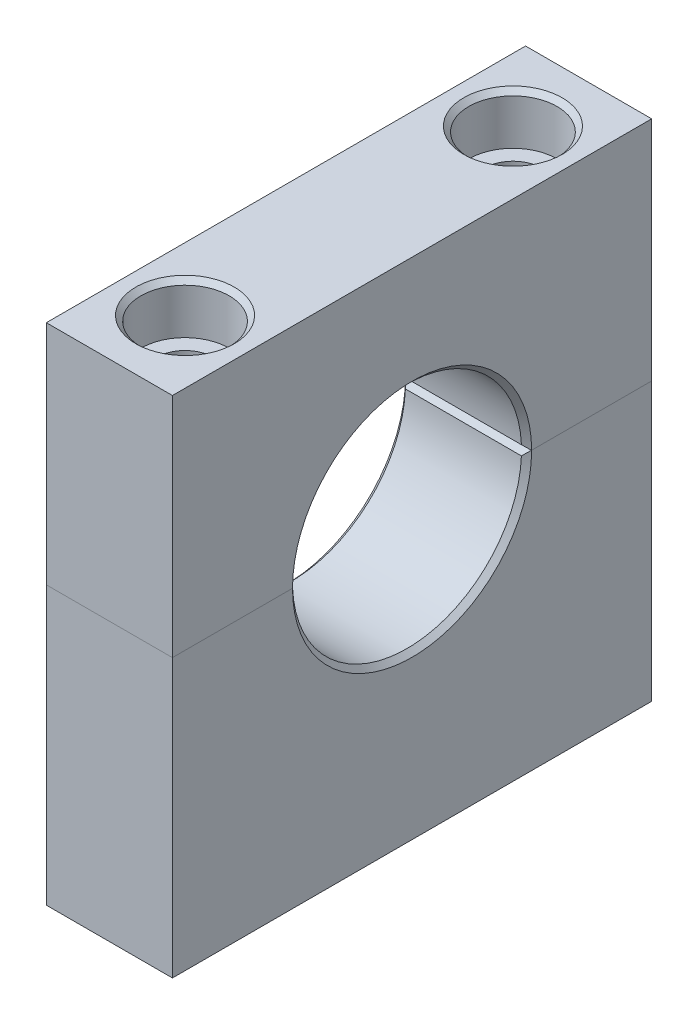
ISO-10303-21;
HEADER;
FILE_DESCRIPTION(('STEP AP214'),'2;1');
FILE_NAME('part.step','',(''),(''),'','','');
FILE_SCHEMA(('AUTOMOTIVE_DESIGN { 1 0 10303 214 1 1 1 1 }'));
ENDSEC;
DATA;
#1=APPLICATION_CONTEXT('core data for automotive mechanical design processes');
#2=APPLICATION_PROTOCOL_DEFINITION('international standard','automotive_design',2000,#1);
#3=PRODUCT_CONTEXT('',#1,'mechanical');
#4=PRODUCT('Part','Part','',(#3));
#5=PRODUCT_RELATED_PRODUCT_CATEGORY('part','',(#4));
#6=PRODUCT_DEFINITION_FORMATION('','',#4);
#7=PRODUCT_DEFINITION_CONTEXT('part definition',#1,'design');
#8=PRODUCT_DEFINITION('design','',#6,#7);
#9=PRODUCT_DEFINITION_SHAPE('','',#8);
#10=(LENGTH_UNIT() NAMED_UNIT(*) SI_UNIT(.MILLI.,.METRE.));
#11=(NAMED_UNIT(*) PLANE_ANGLE_UNIT() SI_UNIT($,.RADIAN.));
#12=(NAMED_UNIT(*) SI_UNIT($,.STERADIAN.) SOLID_ANGLE_UNIT());
#13=UNCERTAINTY_MEASURE_WITH_UNIT(LENGTH_MEASURE(1.E-05),#10,'distance_accuracy_value','');
#14=(GEOMETRIC_REPRESENTATION_CONTEXT(3) GLOBAL_UNCERTAINTY_ASSIGNED_CONTEXT((#13)) GLOBAL_UNIT_ASSIGNED_CONTEXT((#10,
#11,#12)) REPRESENTATION_CONTEXT('',''));
#15=CARTESIAN_POINT('',(0.,0.,0.));
#16=DIRECTION('',(0.,0.,1.));
#17=DIRECTION('',(1.,0.,0.));
#18=AXIS2_PLACEMENT_3D('',#15,#16,#17);
#19=CARTESIAN_POINT('',(15.875,0.,0.));
#20=DIRECTION('',(-1.,0.,0.));
#21=DIRECTION('',(0.,0.,1.));
#22=AXIS2_PLACEMENT_3D('',#19,#20,#21);
#23=CYLINDRICAL_SURFACE('',#22,14.4145);
#24=CARTESIAN_POINT('',(15.24,0.,0.));
#25=DIRECTION('',(1.,0.,0.));
#26=DIRECTION('',(0.,0.,-1.));
#27=AXIS2_PLACEMENT_3D('',#24,#25,#26);
#28=CIRCLE('',#27,14.4145);
#29=CARTESIAN_POINT('',(15.24,0.608206751054859,-14.4016629178012));
#30=VERTEX_POINT('',#29);
#31=CARTESIAN_POINT('',(15.24,0.608206751054859,14.4016629178012));
#32=VERTEX_POINT('',#31);
#33=EDGE_CURVE('E215',#30,#32,#28,.T.);
#34=ORIENTED_EDGE('',*,*,#33,.T.);
#35=DIRECTION('',(-1.,0.,0.));
#36=VECTOR('',#35,1.);
#37=CARTESIAN_POINT('',(15.875,0.608206751054859,14.4016629178012));
#38=LINE('',#37,#36);
#39=CARTESIAN_POINT('',(0.635000000000005,0.608206751054859,14.4016629178012));
#40=VERTEX_POINT('',#39);
#41=EDGE_CURVE('E217',#32,#40,#38,.T.);
#42=ORIENTED_EDGE('',*,*,#41,.T.);
#43=CARTESIAN_POINT('',(0.635000000000005,0.,0.));
#44=DIRECTION('',(1.,0.,0.));
#45=DIRECTION('',(0.,0.,-1.));
#46=AXIS2_PLACEMENT_3D('',#43,#44,#45);
#47=CIRCLE('',#46,14.4145);
#48=CARTESIAN_POINT('',(0.635000000000005,0.608206751054859,-14.4016629178012));
#49=VERTEX_POINT('',#48);
#50=EDGE_CURVE('E156',#40,#49,#47,.F.);
#51=ORIENTED_EDGE('',*,*,#50,.T.);
#52=DIRECTION('',(-1.,0.,0.));
#53=VECTOR('',#52,1.);
#54=CARTESIAN_POINT('',(15.875,0.608206751054859,-14.4016629178012));
#55=LINE('',#54,#53);
#56=EDGE_CURVE('E213',#49,#30,#55,.F.);
#57=ORIENTED_EDGE('',*,*,#56,.T.);
#58=EDGE_LOOP('',(#34,#42,#51,#57));
#59=FACE_BOUND('',#58,.T.);
#60=ADVANCED_FACE('F55',(#59),#23,.F.);
#61=CARTESIAN_POINT('',(15.875,0.,0.));
#62=DIRECTION('',(0.,1.,0.));
#63=DIRECTION('',(0.,0.,1.));
#64=AXIS2_PLACEMENT_3D('',#61,#62,#63);
#65=PLANE('',#64);
#66=CARTESIAN_POINT('',(7.9375,0.,-20.6375));
#67=DIRECTION('',(0.,1.,0.));
#68=DIRECTION('',(0.,0.,1.));
#69=AXIS2_PLACEMENT_3D('',#66,#67,#68);
#70=CIRCLE('',#69,3.57123999999999);
#71=CARTESIAN_POINT('',(7.9375,0.,-17.06626));
#72=VERTEX_POINT('',#71);
#73=EDGE_CURVE('E170',#72,#72,#70,.T.);
#74=ORIENTED_EDGE('',*,*,#73,.T.);
#75=EDGE_LOOP('',(#74));
#76=FACE_BOUND('',#75,.T.);
#77=DIRECTION('',(0.,0.,-1.));
#78=VECTOR('',#77,1.);
#79=CARTESIAN_POINT('',(15.875,0.,0.));
#80=LINE('',#79,#78);
#81=CARTESIAN_POINT('',(15.875,0.,-15.0495));
#82=VERTEX_POINT('',#81);
#83=CARTESIAN_POINT('',(15.875,0.,-30.1625));
#84=VERTEX_POINT('',#83);
#85=EDGE_CURVE('E135',#82,#84,#80,.T.);
#86=ORIENTED_EDGE('',*,*,#85,.F.);
#87=DIRECTION('',(-0.707106781186552,0.,0.707106781186544));
#88=VECTOR('',#87,1.);
#89=CARTESIAN_POINT('',(0.825499999999837,0.,0.));
#90=LINE('',#89,#88);
#91=CARTESIAN_POINT('',(15.8615974075722,0.,-15.0360974075722));
#92=VERTEX_POINT('',#91);
#93=EDGE_CURVE('E70',#82,#92,#90,.T.);
#94=ORIENTED_EDGE('',*,*,#93,.T.);
#95=DIRECTION('',(-1.,0.,0.));
#96=VECTOR('',#95,1.);
#97=CARTESIAN_POINT('',(0.,0.,-15.0360974075722));
#98=LINE('',#97,#96);
#99=CARTESIAN_POINT('',(0.0134025924277798,0.,-15.0360974075722));
#100=VERTEX_POINT('',#99);
#101=EDGE_CURVE('E81',#92,#100,#98,.T.);
#102=ORIENTED_EDGE('',*,*,#101,.T.);
#103=DIRECTION('',(-0.707106781186552,0.,-0.707106781186544));
#104=VECTOR('',#103,1.);
#105=CARTESIAN_POINT('',(15.0495000000002,0.,0.));
#106=LINE('',#105,#104);
#107=CARTESIAN_POINT('',(0.,0.,-15.0495));
#108=VERTEX_POINT('',#107);
#109=EDGE_CURVE('E228',#100,#108,#106,.T.);
#110=ORIENTED_EDGE('',*,*,#109,.T.);
#111=DIRECTION('',(0.,0.,-1.));
#112=VECTOR('',#111,1.);
#113=CARTESIAN_POINT('',(0.,0.,0.));
#114=LINE('',#113,#112);
#115=CARTESIAN_POINT('',(0.,0.,-30.1625));
#116=VERTEX_POINT('',#115);
#117=EDGE_CURVE('E152',#108,#116,#114,.T.);
#118=ORIENTED_EDGE('',*,*,#117,.T.);
#119=DIRECTION('',(-1.,0.,0.));
#120=VECTOR('',#119,1.);
#121=CARTESIAN_POINT('',(15.875,0.,-30.1625));
#122=LINE('',#121,#120);
#123=EDGE_CURVE('E149',#84,#116,#122,.T.);
#124=ORIENTED_EDGE('',*,*,#123,.F.);
#125=EDGE_LOOP('',(#86,#94,#102,#110,#118,#124));
#126=FACE_BOUND('',#125,.T.);
#127=ADVANCED_FACE('F150',(#76,#126),#65,.F.);
#128=CARTESIAN_POINT('',(15.875,0.,-30.1625));
#129=DIRECTION('',(0.,0.,1.));
#130=DIRECTION('',(1.,0.,0.));
#131=AXIS2_PLACEMENT_3D('',#128,#129,#130);
#132=PLANE('',#131);
#133=DIRECTION('',(0.,1.,0.));
#134=VECTOR('',#133,1.);
#135=CARTESIAN_POINT('',(0.,0.,-30.1625));
#136=LINE('',#135,#134);
#137=CARTESIAN_POINT('',(0.,28.575,-30.1625));
#138=VERTEX_POINT('',#137);
#139=EDGE_CURVE('E169',#116,#138,#136,.T.);
#140=ORIENTED_EDGE('',*,*,#139,.T.);
#141=DIRECTION('',(-1.,0.,0.));
#142=VECTOR('',#141,1.);
#143=CARTESIAN_POINT('',(15.875,28.575,-30.1625));
#144=LINE('',#143,#142);
#145=CARTESIAN_POINT('',(15.875,28.575,-30.1625));
#146=VERTEX_POINT('',#145);
#147=EDGE_CURVE('E157',#146,#138,#144,.T.);
#148=ORIENTED_EDGE('',*,*,#147,.F.);
#149=DIRECTION('',(0.,1.,0.));
#150=VECTOR('',#149,1.);
#151=CARTESIAN_POINT('',(15.875,0.,-30.1625));
#152=LINE('',#151,#150);
#153=EDGE_CURVE('E141',#84,#146,#152,.T.);
#154=ORIENTED_EDGE('',*,*,#153,.F.);
#155=ORIENTED_EDGE('',*,*,#123,.T.);
#156=EDGE_LOOP('',(#140,#148,#154,#155));
#157=FACE_BOUND('',#156,.T.);
#158=ADVANCED_FACE('F159',(#157),#132,.F.);
#159=CARTESIAN_POINT('',(15.875,28.575,0.));
#160=DIRECTION('',(0.,1.,0.));
#161=DIRECTION('',(0.,0.,1.));
#162=AXIS2_PLACEMENT_3D('',#159,#160,#161);
#163=PLANE('',#162);
#164=CARTESIAN_POINT('',(7.93750000000001,28.575,20.6375));
#165=DIRECTION('',(0.,1.,0.));
#166=DIRECTION('',(0.,0.,1.));
#167=AXIS2_PLACEMENT_3D('',#164,#165,#166);
#168=CIRCLE('',#167,6.19125);
#169=CARTESIAN_POINT('',(7.93750000000001,28.575,26.82875));
#170=VERTEX_POINT('',#169);
#171=EDGE_CURVE('E190',#170,#170,#168,.T.);
#172=ORIENTED_EDGE('',*,*,#171,.F.);
#173=EDGE_LOOP('',(#172));
#174=FACE_BOUND('',#173,.T.);
#175=CARTESIAN_POINT('',(7.9375,28.575,-20.6375));
#176=DIRECTION('',(0.,1.,0.));
#177=DIRECTION('',(0.,0.,1.));
#178=AXIS2_PLACEMENT_3D('',#175,#176,#177);
#179=CIRCLE('',#178,6.19125);
#180=CARTESIAN_POINT('',(7.9375,28.575,-14.44625));
#181=VERTEX_POINT('',#180);
#182=EDGE_CURVE('E185',#181,#181,#179,.T.);
#183=ORIENTED_EDGE('',*,*,#182,.F.);
#184=EDGE_LOOP('',(#183));
#185=FACE_BOUND('',#184,.T.);
#186=DIRECTION('',(0.,0.,-1.));
#187=VECTOR('',#186,1.);
#188=CARTESIAN_POINT('',(0.,28.575,0.));
#189=LINE('',#188,#187);
#190=CARTESIAN_POINT('',(0.,28.575,30.1625));
#191=VERTEX_POINT('',#190);
#192=EDGE_CURVE('E172',#191,#138,#189,.T.);
#193=ORIENTED_EDGE('',*,*,#192,.F.);
#194=DIRECTION('',(-1.,0.,0.));
#195=VECTOR('',#194,1.);
#196=CARTESIAN_POINT('',(15.875,28.575,30.1625));
#197=LINE('',#196,#195);
#198=CARTESIAN_POINT('',(15.875,28.575,30.1625));
#199=VERTEX_POINT('',#198);
#200=EDGE_CURVE('E177',#199,#191,#197,.T.);
#201=ORIENTED_EDGE('',*,*,#200,.F.);
#202=DIRECTION('',(0.,0.,-1.));
#203=VECTOR('',#202,1.);
#204=CARTESIAN_POINT('',(15.875,28.575,0.));
#205=LINE('',#204,#203);
#206=EDGE_CURVE('E161',#199,#146,#205,.T.);
#207=ORIENTED_EDGE('',*,*,#206,.T.);
#208=ORIENTED_EDGE('',*,*,#147,.T.);
#209=EDGE_LOOP('',(#193,#201,#207,#208));
#210=FACE_BOUND('',#209,.T.);
#211=ADVANCED_FACE('F296',(#174,#185,#210),#163,.T.);
#212=CARTESIAN_POINT('',(15.875,0.,30.1625));
#213=DIRECTION('',(0.,0.,1.));
#214=DIRECTION('',(1.,0.,0.));
#215=AXIS2_PLACEMENT_3D('',#212,#213,#214);
#216=PLANE('',#215);
#217=DIRECTION('',(0.,1.,0.));
#218=VECTOR('',#217,1.);
#219=CARTESIAN_POINT('',(0.,0.,30.1625));
#220=LINE('',#219,#218);
#221=CARTESIAN_POINT('',(0.,0.,30.1625));
#222=VERTEX_POINT('',#221);
#223=EDGE_CURVE('E173',#222,#191,#220,.T.);
#224=ORIENTED_EDGE('',*,*,#223,.F.);
#225=DIRECTION('',(-1.,0.,0.));
#226=VECTOR('',#225,1.);
#227=CARTESIAN_POINT('',(15.875,0.,30.1625));
#228=LINE('',#227,#226);
#229=CARTESIAN_POINT('',(15.875,0.,30.1625));
#230=VERTEX_POINT('',#229);
#231=EDGE_CURVE('E176',#230,#222,#228,.T.);
#232=ORIENTED_EDGE('',*,*,#231,.F.);
#233=DIRECTION('',(0.,1.,0.));
#234=VECTOR('',#233,1.);
#235=CARTESIAN_POINT('',(15.875,0.,30.1625));
#236=LINE('',#235,#234);
#237=EDGE_CURVE('E163',#230,#199,#236,.T.);
#238=ORIENTED_EDGE('',*,*,#237,.T.);
#239=ORIENTED_EDGE('',*,*,#200,.T.);
#240=EDGE_LOOP('',(#224,#232,#238,#239));
#241=FACE_BOUND('',#240,.T.);
#242=ADVANCED_FACE('F299',(#241),#216,.T.);
#243=CARTESIAN_POINT('',(7.93750000000001,0.,20.6375));
#244=DIRECTION('',(0.,1.,0.));
#245=DIRECTION('',(0.,0.,1.));
#246=AXIS2_PLACEMENT_3D('',#243,#244,#245);
#247=CIRCLE('',#246,3.57123999999999);
#248=CARTESIAN_POINT('',(7.93750000000001,0.,24.20874));
#249=VERTEX_POINT('',#248);
#250=EDGE_CURVE('E182',#249,#249,#247,.T.);
#251=ORIENTED_EDGE('',*,*,#250,.T.);
#252=EDGE_LOOP('',(#251));
#253=FACE_BOUND('',#252,.T.);
#254=DIRECTION('',(1.,0.,0.));
#255=VECTOR('',#254,1.);
#256=CARTESIAN_POINT('',(15.875,0.,15.0360974075722));
#257=LINE('',#256,#255);
#258=CARTESIAN_POINT('',(0.0134025924277796,0.,15.0360974075722));
#259=VERTEX_POINT('',#258);
#260=CARTESIAN_POINT('',(15.8615974075722,0.,15.0360974075722));
#261=VERTEX_POINT('',#260);
#262=EDGE_CURVE('E222',#259,#261,#257,.T.);
#263=ORIENTED_EDGE('',*,*,#262,.T.);
#264=DIRECTION('',(0.707106781186552,0.,0.707106781186544));
#265=VECTOR('',#264,1.);
#266=CARTESIAN_POINT('',(0.825499999999837,0.,0.));
#267=LINE('',#266,#265);
#268=CARTESIAN_POINT('',(15.875,0.,15.0495));
#269=VERTEX_POINT('',#268);
#270=EDGE_CURVE('E225',#261,#269,#267,.T.);
#271=ORIENTED_EDGE('',*,*,#270,.T.);
#272=EDGE_CURVE('E147',#230,#269,#80,.T.);
#273=ORIENTED_EDGE('',*,*,#272,.F.);
#274=ORIENTED_EDGE('',*,*,#231,.T.);
#275=CARTESIAN_POINT('',(0.,0.,15.0495));
#276=VERTEX_POINT('',#275);
#277=EDGE_CURVE('E145',#222,#276,#114,.T.);
#278=ORIENTED_EDGE('',*,*,#277,.T.);
#279=DIRECTION('',(0.707106781186552,0.,-0.707106781186544));
#280=VECTOR('',#279,1.);
#281=CARTESIAN_POINT('',(15.0495000000002,0.,0.));
#282=LINE('',#281,#280);
#283=EDGE_CURVE('E220',#276,#259,#282,.T.);
#284=ORIENTED_EDGE('',*,*,#283,.T.);
#285=EDGE_LOOP('',(#263,#271,#273,#274,#278,#284));
#286=FACE_BOUND('',#285,.T.);
#287=ADVANCED_FACE('F281',(#253,#286),#65,.F.);
#288=CARTESIAN_POINT('',(15.875,0.,0.));
#289=DIRECTION('',(1.,0.,0.));
#290=DIRECTION('',(0.,0.,-1.));
#291=AXIS2_PLACEMENT_3D('',#288,#289,#290);
#292=PLANE('',#291);
#293=ORIENTED_EDGE('',*,*,#272,.T.);
#294=CARTESIAN_POINT('',(15.875,0.,0.));
#295=DIRECTION('',(1.,0.,0.));
#296=DIRECTION('',(0.,0.,-1.));
#297=AXIS2_PLACEMENT_3D('',#294,#295,#296);
#298=CIRCLE('',#297,15.0495);
#299=EDGE_CURVE('E144',#269,#82,#298,.F.);
#300=ORIENTED_EDGE('',*,*,#299,.T.);
#301=ORIENTED_EDGE('',*,*,#85,.T.);
#302=ORIENTED_EDGE('',*,*,#153,.T.);
#303=ORIENTED_EDGE('',*,*,#206,.F.);
#304=ORIENTED_EDGE('',*,*,#237,.F.);
#305=EDGE_LOOP('',(#293,#300,#301,#302,#303,#304));
#306=FACE_BOUND('',#305,.T.);
#307=ADVANCED_FACE('F138',(#306),#292,.T.);
#308=CARTESIAN_POINT('',(0.,0.,0.));
#309=DIRECTION('',(1.,0.,0.));
#310=DIRECTION('',(0.,0.,-1.));
#311=AXIS2_PLACEMENT_3D('',#308,#309,#310);
#312=PLANE('',#311);
#313=ORIENTED_EDGE('',*,*,#117,.F.);
#314=CARTESIAN_POINT('',(0.,0.,0.));
#315=DIRECTION('',(1.,0.,0.));
#316=DIRECTION('',(0.,0.,-1.));
#317=AXIS2_PLACEMENT_3D('',#314,#315,#316);
#318=CIRCLE('',#317,15.0495);
#319=EDGE_CURVE('E13',#108,#276,#318,.T.);
#320=ORIENTED_EDGE('',*,*,#319,.T.);
#321=ORIENTED_EDGE('',*,*,#277,.F.);
#322=ORIENTED_EDGE('',*,*,#223,.T.);
#323=ORIENTED_EDGE('',*,*,#192,.T.);
#324=ORIENTED_EDGE('',*,*,#139,.F.);
#325=EDGE_LOOP('',(#313,#320,#321,#322,#323,#324));
#326=FACE_BOUND('',#325,.T.);
#327=ADVANCED_FACE('F329',(#326),#312,.F.);
#328=CARTESIAN_POINT('',(7.9375,34.925,-20.6375));
#329=DIRECTION('',(0.,1.,0.));
#330=DIRECTION('',(0.,0.,1.));
#331=AXIS2_PLACEMENT_3D('',#328,#329,#330);
#332=CYLINDRICAL_SURFACE('',#331,3.57123999999999);
#333=CARTESIAN_POINT('',(7.9375,22.225,-20.6375));
#334=DIRECTION('',(0.,1.,0.));
#335=DIRECTION('',(0.,0.,1.));
#336=AXIS2_PLACEMENT_3D('',#333,#334,#335);
#337=CIRCLE('',#336,3.57124);
#338=CARTESIAN_POINT('',(7.9375,22.225,-17.06626));
#339=VERTEX_POINT('',#338);
#340=EDGE_CURVE('E181',#339,#339,#337,.T.);
#341=ORIENTED_EDGE('',*,*,#340,.T.);
#342=EDGE_LOOP('',(#341));
#343=FACE_BOUND('',#342,.T.);
#344=ORIENTED_EDGE('',*,*,#73,.F.);
#345=EDGE_LOOP('',(#344));
#346=FACE_BOUND('',#345,.T.);
#347=ADVANCED_FACE('F294',(#343,#346),#332,.F.);
#348=CARTESIAN_POINT('',(13.49375,22.225,-20.6375));
#349=DIRECTION('',(0.,-1.,0.));
#350=DIRECTION('',(0.,0.,-1.));
#351=AXIS2_PLACEMENT_3D('',#348,#349,#350);
#352=PLANE('',#351);
#353=ORIENTED_EDGE('',*,*,#340,.F.);
#354=EDGE_LOOP('',(#353));
#355=FACE_BOUND('',#354,.T.);
#356=CARTESIAN_POINT('',(7.9375,22.225,-20.6375));
#357=DIRECTION('',(0.,1.,0.));
#358=DIRECTION('',(0.,0.,1.));
#359=AXIS2_PLACEMENT_3D('',#356,#357,#358);
#360=CIRCLE('',#359,5.55625);
#361=CARTESIAN_POINT('',(7.9375,22.225,-15.08125));
#362=VERTEX_POINT('',#361);
#363=EDGE_CURVE('E196',#362,#362,#360,.T.);
#364=ORIENTED_EDGE('',*,*,#363,.T.);
#365=EDGE_LOOP('',(#364));
#366=FACE_BOUND('',#365,.T.);
#367=ADVANCED_FACE('F291',(#355,#366),#352,.F.);
#368=CARTESIAN_POINT('',(7.9375,34.925,-20.6375));
#369=DIRECTION('',(0.,1.,0.));
#370=DIRECTION('',(0.,0.,1.));
#371=AXIS2_PLACEMENT_3D('',#368,#369,#370);
#372=CYLINDRICAL_SURFACE('',#371,5.55625);
#373=ORIENTED_EDGE('',*,*,#363,.F.);
#374=EDGE_LOOP('',(#373));
#375=FACE_BOUND('',#374,.T.);
#376=CARTESIAN_POINT('',(7.9375,27.94,-20.6375));
#377=DIRECTION('',(0.,1.,0.));
#378=DIRECTION('',(0.,0.,1.));
#379=AXIS2_PLACEMENT_3D('',#376,#377,#378);
#380=CIRCLE('',#379,5.55625);
#381=CARTESIAN_POINT('',(7.9375,27.94,-15.08125));
#382=VERTEX_POINT('',#381);
#383=EDGE_CURVE('E189',#382,#382,#380,.T.);
#384=ORIENTED_EDGE('',*,*,#383,.T.);
#385=EDGE_LOOP('',(#384));
#386=FACE_BOUND('',#385,.T.);
#387=ADVANCED_FACE('F289',(#375,#386),#372,.F.);
#388=CARTESIAN_POINT('',(7.9375,28.575,-20.6375));
#389=DIRECTION('',(0.,1.,0.));
#390=DIRECTION('',(0.,0.,1.));
#391=AXIS2_PLACEMENT_3D('',#388,#389,#390);
#392=CONICAL_SURFACE('',#391,6.19125,0.785398163397446);
#393=ORIENTED_EDGE('',*,*,#383,.F.);
#394=EDGE_LOOP('',(#393));
#395=FACE_BOUND('',#394,.T.);
#396=ORIENTED_EDGE('',*,*,#182,.T.);
#397=EDGE_LOOP('',(#396));
#398=FACE_BOUND('',#397,.T.);
#399=ADVANCED_FACE('F285',(#395,#398),#392,.F.);
#400=CARTESIAN_POINT('',(7.93750000000001,34.925,20.6375));
#401=DIRECTION('',(0.,1.,0.));
#402=DIRECTION('',(0.,0.,1.));
#403=AXIS2_PLACEMENT_3D('',#400,#401,#402);
#404=CYLINDRICAL_SURFACE('',#403,3.57123999999999);
#405=CARTESIAN_POINT('',(7.93750000000001,22.225,20.6375));
#406=DIRECTION('',(0.,1.,0.));
#407=DIRECTION('',(0.,0.,1.));
#408=AXIS2_PLACEMENT_3D('',#405,#406,#407);
#409=CIRCLE('',#408,3.57124);
#410=CARTESIAN_POINT('',(7.93750000000001,22.225,24.20874));
#411=VERTEX_POINT('',#410);
#412=EDGE_CURVE('E186',#411,#411,#409,.T.);
#413=ORIENTED_EDGE('',*,*,#412,.T.);
#414=EDGE_LOOP('',(#413));
#415=FACE_BOUND('',#414,.T.);
#416=ORIENTED_EDGE('',*,*,#250,.F.);
#417=EDGE_LOOP('',(#416));
#418=FACE_BOUND('',#417,.T.);
#419=ADVANCED_FACE('F288',(#415,#418),#404,.F.);
#420=CARTESIAN_POINT('',(13.49375,22.225,20.6375));
#421=DIRECTION('',(0.,-1.,0.));
#422=DIRECTION('',(0.,0.,-1.));
#423=AXIS2_PLACEMENT_3D('',#420,#421,#422);
#424=PLANE('',#423);
#425=ORIENTED_EDGE('',*,*,#412,.F.);
#426=EDGE_LOOP('',(#425));
#427=FACE_BOUND('',#426,.T.);
#428=CARTESIAN_POINT('',(7.93750000000001,22.225,20.6375));
#429=DIRECTION('',(0.,1.,0.));
#430=DIRECTION('',(0.,0.,1.));
#431=AXIS2_PLACEMENT_3D('',#428,#429,#430);
#432=CIRCLE('',#431,5.55625);
#433=CARTESIAN_POINT('',(7.93750000000001,22.225,26.19375));
#434=VERTEX_POINT('',#433);
#435=EDGE_CURVE('E203',#434,#434,#432,.T.);
#436=ORIENTED_EDGE('',*,*,#435,.T.);
#437=EDGE_LOOP('',(#436));
#438=FACE_BOUND('',#437,.T.);
#439=ADVANCED_FACE('F304',(#427,#438),#424,.F.);
#440=CARTESIAN_POINT('',(7.93750000000001,34.925,20.6375));
#441=DIRECTION('',(0.,1.,0.));
#442=DIRECTION('',(0.,0.,1.));
#443=AXIS2_PLACEMENT_3D('',#440,#441,#442);
#444=CYLINDRICAL_SURFACE('',#443,5.55625);
#445=ORIENTED_EDGE('',*,*,#435,.F.);
#446=EDGE_LOOP('',(#445));
#447=FACE_BOUND('',#446,.T.);
#448=CARTESIAN_POINT('',(7.93750000000001,27.94,20.6375));
#449=DIRECTION('',(0.,1.,0.));
#450=DIRECTION('',(0.,0.,1.));
#451=AXIS2_PLACEMENT_3D('',#448,#449,#450);
#452=CIRCLE('',#451,5.55625);
#453=CARTESIAN_POINT('',(7.93750000000001,27.94,26.19375));
#454=VERTEX_POINT('',#453);
#455=EDGE_CURVE('E193',#454,#454,#452,.T.);
#456=ORIENTED_EDGE('',*,*,#455,.T.);
#457=EDGE_LOOP('',(#456));
#458=FACE_BOUND('',#457,.T.);
#459=ADVANCED_FACE('F302',(#447,#458),#444,.F.);
#460=CARTESIAN_POINT('',(7.93750000000001,28.575,20.6375));
#461=DIRECTION('',(0.,1.,0.));
#462=DIRECTION('',(0.,0.,1.));
#463=AXIS2_PLACEMENT_3D('',#460,#461,#462);
#464=CONICAL_SURFACE('',#463,6.19125,0.785398163397446);
#465=ORIENTED_EDGE('',*,*,#455,.F.);
#466=EDGE_LOOP('',(#465));
#467=FACE_BOUND('',#466,.T.);
#468=ORIENTED_EDGE('',*,*,#171,.T.);
#469=EDGE_LOOP('',(#468));
#470=FACE_BOUND('',#469,.T.);
#471=ADVANCED_FACE('F270',(#467,#470),#464,.F.);
#472=CARTESIAN_POINT('',(15.875,0.,-15.0360974075722));
#473=DIRECTION('',(0.,0.721870519146957,-0.692028145082628));
#474=DIRECTION('',(-1.,0.,0.));
#475=AXIS2_PLACEMENT_3D('',#472,#473,#474);
#476=PLANE('',#475);
#477=CARTESIAN_POINT('',(0.0134025924277798,0.,-15.0360974075722));
#478=CARTESIAN_POINT('',(0.0659094272433899,0.0503363643994962,-14.9835903849038));
#479=CARTESIAN_POINT('',(0.118250385734316,0.100755667495606,-14.930996846968));
#480=CARTESIAN_POINT('',(0.222583333504488,0.201764996806373,-14.825631685874));
#481=CARTESIAN_POINT('',(0.274575331376771,0.252355018770693,-14.7728600671493));
#482=CARTESIAN_POINT('',(0.378195819474749,0.353713198434636,-14.667131012206));
#483=CARTESIAN_POINT('',(0.429824309131528,0.404481356412868,-14.6141735756966));
#484=CARTESIAN_POINT('',(0.532701597847224,0.506203430976733,-14.5080649335902));
#485=CARTESIAN_POINT('',(0.583950387489736,0.557157352122771,-14.4549137232361));
#486=CARTESIAN_POINT('',(0.635000000000007,0.608206751054859,-14.4016629178012));
#487=B_SPLINE_CURVE_WITH_KNOTS('',3,(#477,#478,#479,#480,#481,#482,#483,#484,#485,#486),
.UNSPECIFIED.,.F.,.F.,(4,2,2,2,4),(0.,0.269126892982655,0.538247134310661,0.8073677967372,
1.07649511105641),.UNSPECIFIED.);
#488=EDGE_CURVE('E341',#100,#49,#487,.T.);
#489=ORIENTED_EDGE('',*,*,#488,.F.);
#490=ORIENTED_EDGE('',*,*,#101,.F.);
#491=CARTESIAN_POINT('',(15.8615974075722,0.,-15.0360974075722));
#492=CARTESIAN_POINT('',(15.8090905727566,0.0503363643994966,-14.9835903849038));
#493=CARTESIAN_POINT('',(15.7567496142657,0.100755667495607,-14.930996846968));
#494=CARTESIAN_POINT('',(15.6524166664955,0.201764996806374,-14.825631685874));
#495=CARTESIAN_POINT('',(15.6004246686232,0.252355018770694,-14.7728600671493));
#496=CARTESIAN_POINT('',(15.4968041805253,0.353713198434637,-14.667131012206));
#497=CARTESIAN_POINT('',(15.4451756908685,0.404481356412869,-14.6141735756966));
#498=CARTESIAN_POINT('',(15.3422984021528,0.506203430976734,-14.5080649335902));
#499=CARTESIAN_POINT('',(15.2910496125103,0.557157352122772,-14.4549137232361));
#500=CARTESIAN_POINT('',(15.24,0.608206751054859,-14.4016629178012));
#501=B_SPLINE_CURVE_WITH_KNOTS('',3,(#491,#492,#493,#494,#495,#496,#497,#498,#499,#500),
.UNSPECIFIED.,.F.,.F.,(4,2,2,2,4),(0.,0.269126892982657,0.538247134310662,0.8073677967372,
1.07649511105641),.UNSPECIFIED.);
#502=EDGE_CURVE('E61',#30,#92,#501,.F.);
#503=ORIENTED_EDGE('',*,*,#502,.F.);
#504=ORIENTED_EDGE('',*,*,#56,.F.);
#505=EDGE_LOOP('',(#489,#490,#503,#504));
#506=FACE_BOUND('',#505,.T.);
#507=ADVANCED_FACE('F58',(#506),#476,.F.);
#508=CARTESIAN_POINT('',(15.24,0.,0.));
#509=DIRECTION('',(1.,0.,0.));
#510=DIRECTION('',(0.,0.,-1.));
#511=AXIS2_PLACEMENT_3D('',#508,#509,#510);
#512=CONICAL_SURFACE('',#511,14.4145,0.785398163397443);
#513=ORIENTED_EDGE('',*,*,#299,.F.);
#514=ORIENTED_EDGE('',*,*,#270,.F.);
#515=CARTESIAN_POINT('',(15.8615974075722,0.,15.0360974075722));
#516=CARTESIAN_POINT('',(15.8090905727566,0.0503363643994966,14.9835903849038));
#517=CARTESIAN_POINT('',(15.7567496142657,0.100755667495607,14.930996846968));
#518=CARTESIAN_POINT('',(15.6524166664955,0.201764996806374,14.825631685874));
#519=CARTESIAN_POINT('',(15.6004246686232,0.252355018770694,14.7728600671493));
#520=CARTESIAN_POINT('',(15.4968041805253,0.353713198434637,14.667131012206));
#521=CARTESIAN_POINT('',(15.4451756908685,0.404481356412869,14.6141735756966));
#522=CARTESIAN_POINT('',(15.3422984021528,0.506203430976734,14.5080649335902));
#523=CARTESIAN_POINT('',(15.2910496125103,0.557157352122772,14.4549137232361));
#524=CARTESIAN_POINT('',(15.24,0.608206751054859,14.4016629178012));
#525=B_SPLINE_CURVE_WITH_KNOTS('',3,(#515,#516,#517,#518,#519,#520,#521,#522,#523,#524),
.UNSPECIFIED.,.F.,.F.,(4,2,2,2,4),(0.,0.269126892982657,0.538247134310662,0.8073677967372,
1.07649511105641),.UNSPECIFIED.);
#526=EDGE_CURVE('E240',#32,#261,#525,.F.);
#527=ORIENTED_EDGE('',*,*,#526,.F.);
#528=ORIENTED_EDGE('',*,*,#33,.F.);
#529=ORIENTED_EDGE('',*,*,#502,.T.);
#530=ORIENTED_EDGE('',*,*,#93,.F.);
#531=EDGE_LOOP('',(#513,#514,#527,#528,#529,#530));
#532=FACE_BOUND('',#531,.T.);
#533=ADVANCED_FACE('F257',(#532),#512,.F.);
#534=CARTESIAN_POINT('',(0.,0.,0.));
#535=DIRECTION('',(-1.,0.,0.));
#536=DIRECTION('',(0.,0.,1.));
#537=AXIS2_PLACEMENT_3D('',#534,#535,#536);
#538=CONICAL_SURFACE('',#537,15.0495,0.785398163397443);
#539=ORIENTED_EDGE('',*,*,#488,.T.);
#540=ORIENTED_EDGE('',*,*,#50,.F.);
#541=CARTESIAN_POINT('',(0.635000000000005,0.608206751054859,14.4016629178012));
#542=CARTESIAN_POINT('',(0.583950387489735,0.557157352122772,14.4549137232361));
#543=CARTESIAN_POINT('',(0.532701597847224,0.506203430976734,14.5080649335902));
#544=CARTESIAN_POINT('',(0.429824309131528,0.404481356412868,14.6141735756966));
#545=CARTESIAN_POINT('',(0.378195819474749,0.353713198434636,14.667131012206));
#546=CARTESIAN_POINT('',(0.274575331376771,0.252355018770693,14.7728600671493));
#547=CARTESIAN_POINT('',(0.222583333504487,0.201764996806373,14.825631685874));
#548=CARTESIAN_POINT('',(0.118250385734316,0.100755667495605,14.930996846968));
#549=CARTESIAN_POINT('',(0.0659094272433901,0.0503363643994954,14.9835903849038));
#550=CARTESIAN_POINT('',(0.0134025924277814,0.,15.0360974075722));
#551=B_SPLINE_CURVE_WITH_KNOTS('',3,(#541,#542,#543,#544,#545,#546,#547,#548,#549,#550),
.UNSPECIFIED.,.F.,.F.,(4,2,2,2,4),(0.,0.269127314319214,0.538247976745752,0.807368218073758,
1.07649511105641),.UNSPECIFIED.);
#552=EDGE_CURVE('E232',#259,#40,#551,.F.);
#553=ORIENTED_EDGE('',*,*,#552,.F.);
#554=ORIENTED_EDGE('',*,*,#283,.F.);
#555=ORIENTED_EDGE('',*,*,#319,.F.);
#556=ORIENTED_EDGE('',*,*,#109,.F.);
#557=EDGE_LOOP('',(#539,#540,#553,#554,#555,#556));
#558=FACE_BOUND('',#557,.T.);
#559=ADVANCED_FACE('F246',(#558),#538,.F.);
#560=CARTESIAN_POINT('',(15.875,0.608206751054858,14.4016629178012));
#561=DIRECTION('',(0.,0.721870519146957,0.692028145082628));
#562=DIRECTION('',(-1.,0.,0.));
#563=AXIS2_PLACEMENT_3D('',#560,#561,#562);
#564=PLANE('',#563);
#565=ORIENTED_EDGE('',*,*,#526,.T.);
#566=ORIENTED_EDGE('',*,*,#262,.F.);
#567=ORIENTED_EDGE('',*,*,#552,.T.);
#568=ORIENTED_EDGE('',*,*,#41,.F.);
#569=EDGE_LOOP('',(#565,#566,#567,#568));
#570=FACE_BOUND('',#569,.T.);
#571=ADVANCED_FACE('F250',(#570),#564,.F.);
#572=CLOSED_SHELL('',(#60,#127,#158,#211,#242,#287,#307,#327,#347,#367,#387,#399,#419,#439,#459,
#471,#507,#533,#559,#571));
#573=MANIFOLD_SOLID_BREP('B2',#572);
#574=CARTESIAN_POINT('',(15.875,0.,0.));
#575=DIRECTION('',(-1.,0.,0.));
#576=DIRECTION('',(0.,0.,1.));
#577=AXIS2_PLACEMENT_3D('',#574,#575,#576);
#578=CYLINDRICAL_SURFACE('',#577,14.4145);
#579=CARTESIAN_POINT('',(15.24,0.,0.));
#580=DIRECTION('',(1.,0.,0.));
#581=DIRECTION('',(0.,0.,-1.));
#582=AXIS2_PLACEMENT_3D('',#579,#580,#581);
#583=CIRCLE('',#582,14.4145);
#584=CARTESIAN_POINT('',(15.24,-0.608206751054859,14.4016629178012));
#585=VERTEX_POINT('',#584);
#586=CARTESIAN_POINT('',(15.24,-0.608206751054859,-14.4016629178012));
#587=VERTEX_POINT('',#586);
#588=EDGE_CURVE('E635',#585,#587,#583,.T.);
#589=ORIENTED_EDGE('',*,*,#588,.T.);
#590=DIRECTION('',(-1.,0.,0.));
#591=VECTOR('',#590,1.);
#592=CARTESIAN_POINT('',(15.875,-0.608206751054859,-14.4016629178012));
#593=LINE('',#592,#591);
#594=CARTESIAN_POINT('',(0.635000000000006,-0.608206751054859,-14.4016629178012));
#595=VERTEX_POINT('',#594);
#596=EDGE_CURVE('E637',#587,#595,#593,.T.);
#597=ORIENTED_EDGE('',*,*,#596,.T.);
#598=CARTESIAN_POINT('',(0.635000000000005,0.,0.));
#599=DIRECTION('',(1.,0.,0.));
#600=DIRECTION('',(0.,0.,-1.));
#601=AXIS2_PLACEMENT_3D('',#598,#599,#600);
#602=CIRCLE('',#601,14.4145);
#603=CARTESIAN_POINT('',(0.635000000000006,-0.608206751054859,14.4016629178012));
#604=VERTEX_POINT('',#603);
#605=EDGE_CURVE('E590',#595,#604,#602,.F.);
#606=ORIENTED_EDGE('',*,*,#605,.T.);
#607=DIRECTION('',(-1.,0.,0.));
#608=VECTOR('',#607,1.);
#609=CARTESIAN_POINT('',(15.875,-0.608206751054859,14.4016629178012));
#610=LINE('',#609,#608);
#611=EDGE_CURVE('E633',#604,#585,#610,.F.);
#612=ORIENTED_EDGE('',*,*,#611,.T.);
#613=EDGE_LOOP('',(#589,#597,#606,#612));
#614=FACE_BOUND('',#613,.T.);
#615=ADVANCED_FACE('F500',(#614),#578,.F.);
#616=CARTESIAN_POINT('',(15.875,0.,0.));
#617=DIRECTION('',(0.,1.,0.));
#618=DIRECTION('',(0.,0.,1.));
#619=AXIS2_PLACEMENT_3D('',#616,#617,#618);
#620=PLANE('',#619);
#621=CARTESIAN_POINT('',(7.93750000000001,0.,20.6375));
#622=DIRECTION('',(0.,1.,0.));
#623=DIRECTION('',(0.,0.,1.));
#624=AXIS2_PLACEMENT_3D('',#621,#622,#623);
#625=CIRCLE('',#624,3.57123999999999);
#626=CARTESIAN_POINT('',(7.93750000000001,0.,24.20874));
#627=VERTEX_POINT('',#626);
#628=EDGE_CURVE('E730',#627,#627,#625,.T.);
#629=ORIENTED_EDGE('',*,*,#628,.F.);
#630=EDGE_LOOP('',(#629));
#631=FACE_BOUND('',#630,.T.);
#632=DIRECTION('',(0.,0.,-1.));
#633=VECTOR('',#632,1.);
#634=CARTESIAN_POINT('',(15.875,0.,0.));
#635=LINE('',#634,#633);
#636=CARTESIAN_POINT('',(15.875,0.,30.1625));
#637=VERTEX_POINT('',#636);
#638=CARTESIAN_POINT('',(15.875,0.,15.0495));
#639=VERTEX_POINT('',#638);
#640=EDGE_CURVE('E583',#637,#639,#635,.T.);
#641=ORIENTED_EDGE('',*,*,#640,.T.);
#642=DIRECTION('',(0.707106781186544,0.,0.707106781186551));
#643=VECTOR('',#642,1.);
#644=CARTESIAN_POINT('',(0.825500000000151,0.,0.));
#645=LINE('',#644,#643);
#646=CARTESIAN_POINT('',(15.8615974075722,0.,15.0360974075722));
#647=VERTEX_POINT('',#646);
#648=EDGE_CURVE('E515',#639,#647,#645,.F.);
#649=ORIENTED_EDGE('',*,*,#648,.T.);
#650=DIRECTION('',(-1.,0.,0.));
#651=VECTOR('',#650,1.);
#652=CARTESIAN_POINT('',(15.875,0.,15.0360974075722));
#653=LINE('',#652,#651);
#654=CARTESIAN_POINT('',(0.0134025924277796,0.,15.0360974075722));
#655=VERTEX_POINT('',#654);
#656=EDGE_CURVE('E526',#647,#655,#653,.T.);
#657=ORIENTED_EDGE('',*,*,#656,.T.);
#658=DIRECTION('',(0.707106781186544,0.,-0.707106781186551));
#659=VECTOR('',#658,1.);
#660=CARTESIAN_POINT('',(15.0494999999998,0.,0.));
#661=LINE('',#660,#659);
#662=CARTESIAN_POINT('',(0.,0.,15.0495));
#663=VERTEX_POINT('',#662);
#664=EDGE_CURVE('E648',#655,#663,#661,.F.);
#665=ORIENTED_EDGE('',*,*,#664,.T.);
#666=DIRECTION('',(0.,0.,-1.));
#667=VECTOR('',#666,1.);
#668=CARTESIAN_POINT('',(0.,0.,0.));
#669=LINE('',#668,#667);
#670=CARTESIAN_POINT('',(0.,0.,30.1625));
#671=VERTEX_POINT('',#670);
#672=EDGE_CURVE('E585',#671,#663,#669,.T.);
#673=ORIENTED_EDGE('',*,*,#672,.F.);
#674=DIRECTION('',(-1.,0.,0.));
#675=VECTOR('',#674,1.);
#676=CARTESIAN_POINT('',(15.875,0.,30.1625));
#677=LINE('',#676,#675);
#678=EDGE_CURVE('E580',#637,#671,#677,.T.);
#679=ORIENTED_EDGE('',*,*,#678,.F.);
#680=EDGE_LOOP('',(#641,#649,#657,#665,#673,#679));
#681=FACE_BOUND('',#680,.T.);
#682=ADVANCED_FACE('F582',(#631,#681),#620,.T.);
#683=CARTESIAN_POINT('',(15.875,0.,30.1625));
#684=DIRECTION('',(0.,0.,1.));
#685=DIRECTION('',(1.,0.,0.));
#686=AXIS2_PLACEMENT_3D('',#683,#684,#685);
#687=PLANE('',#686);
#688=DIRECTION('',(0.,1.,0.));
#689=VECTOR('',#688,1.);
#690=CARTESIAN_POINT('',(0.,0.,30.1625));
#691=LINE('',#690,#689);
#692=CARTESIAN_POINT('',(0.,-34.925,30.1625));
#693=VERTEX_POINT('',#692);
#694=EDGE_CURVE('E614',#693,#671,#691,.T.);
#695=ORIENTED_EDGE('',*,*,#694,.F.);
#696=DIRECTION('',(-1.,0.,0.));
#697=VECTOR('',#696,1.);
#698=CARTESIAN_POINT('',(15.875,-34.925,30.1625));
#699=LINE('',#698,#697);
#700=CARTESIAN_POINT('',(15.875,-34.925,30.1625));
#701=VERTEX_POINT('',#700);
#702=EDGE_CURVE('E591',#701,#693,#699,.T.);
#703=ORIENTED_EDGE('',*,*,#702,.F.);
#704=DIRECTION('',(0.,1.,0.));
#705=VECTOR('',#704,1.);
#706=CARTESIAN_POINT('',(15.875,0.,30.1625));
#707=LINE('',#706,#705);
#708=EDGE_CURVE('E597',#701,#637,#707,.T.);
#709=ORIENTED_EDGE('',*,*,#708,.T.);
#710=ORIENTED_EDGE('',*,*,#678,.T.);
#711=EDGE_LOOP('',(#695,#703,#709,#710));
#712=FACE_BOUND('',#711,.T.);
#713=ADVANCED_FACE('F603',(#712),#687,.T.);
#714=CARTESIAN_POINT('',(15.875,-34.925,0.));
#715=DIRECTION('',(0.,1.,0.));
#716=DIRECTION('',(0.,0.,1.));
#717=AXIS2_PLACEMENT_3D('',#714,#715,#716);
#718=PLANE('',#717);
#719=CARTESIAN_POINT('',(7.93750000000001,-34.925,20.6375));
#720=DIRECTION('',(0.,1.,0.));
#721=DIRECTION('',(0.,0.,1.));
#722=AXIS2_PLACEMENT_3D('',#719,#720,#721);
#723=CIRCLE('',#722,3.57123999999998);
#724=CARTESIAN_POINT('',(7.93750000000001,-34.925,24.20874));
#725=VERTEX_POINT('',#724);
#726=EDGE_CURVE('E733',#725,#725,#723,.T.);
#727=ORIENTED_EDGE('',*,*,#726,.T.);
#728=EDGE_LOOP('',(#727));
#729=FACE_BOUND('',#728,.T.);
#730=CARTESIAN_POINT('',(7.9375,-34.925,-20.6375));
#731=DIRECTION('',(0.,1.,0.));
#732=DIRECTION('',(0.,0.,1.));
#733=AXIS2_PLACEMENT_3D('',#730,#731,#732);
#734=CIRCLE('',#733,3.57123999999998);
#735=CARTESIAN_POINT('',(7.9375,-34.925,-17.06626));
#736=VERTEX_POINT('',#735);
#737=EDGE_CURVE('E631',#736,#736,#734,.T.);
#738=ORIENTED_EDGE('',*,*,#737,.T.);
#739=EDGE_LOOP('',(#738));
#740=FACE_BOUND('',#739,.T.);
#741=DIRECTION('',(0.,0.,-1.));
#742=VECTOR('',#741,1.);
#743=CARTESIAN_POINT('',(0.,-34.925,0.));
#744=LINE('',#743,#742);
#745=CARTESIAN_POINT('',(0.,-34.925,-30.1625));
#746=VERTEX_POINT('',#745);
#747=EDGE_CURVE('E617',#693,#746,#744,.T.);
#748=ORIENTED_EDGE('',*,*,#747,.T.);
#749=DIRECTION('',(-1.,0.,0.));
#750=VECTOR('',#749,1.);
#751=CARTESIAN_POINT('',(15.875,-34.925,-30.1625));
#752=LINE('',#751,#750);
#753=CARTESIAN_POINT('',(15.875,-34.925,-30.1625));
#754=VERTEX_POINT('',#753);
#755=EDGE_CURVE('E625',#754,#746,#752,.T.);
#756=ORIENTED_EDGE('',*,*,#755,.F.);
#757=DIRECTION('',(0.,0.,-1.));
#758=VECTOR('',#757,1.);
#759=CARTESIAN_POINT('',(15.875,-34.925,0.));
#760=LINE('',#759,#758);
#761=EDGE_CURVE('E605',#701,#754,#760,.T.);
#762=ORIENTED_EDGE('',*,*,#761,.F.);
#763=ORIENTED_EDGE('',*,*,#702,.T.);
#764=EDGE_LOOP('',(#748,#756,#762,#763));
#765=FACE_BOUND('',#764,.T.);
#766=ADVANCED_FACE('F704',(#729,#740,#765),#718,.F.);
#767=CARTESIAN_POINT('',(15.875,0.,-30.1625));
#768=DIRECTION('',(0.,0.,1.));
#769=DIRECTION('',(1.,0.,0.));
#770=AXIS2_PLACEMENT_3D('',#767,#768,#769);
#771=PLANE('',#770);
#772=DIRECTION('',(0.,1.,0.));
#773=VECTOR('',#772,1.);
#774=CARTESIAN_POINT('',(0.,0.,-30.1625));
#775=LINE('',#774,#773);
#776=CARTESIAN_POINT('',(0.,0.,-30.1625));
#777=VERTEX_POINT('',#776);
#778=EDGE_CURVE('E619',#746,#777,#775,.T.);
#779=ORIENTED_EDGE('',*,*,#778,.T.);
#780=DIRECTION('',(-1.,0.,0.));
#781=VECTOR('',#780,1.);
#782=CARTESIAN_POINT('',(15.875,0.,-30.1625));
#783=LINE('',#782,#781);
#784=CARTESIAN_POINT('',(15.875,0.,-30.1625));
#785=VERTEX_POINT('',#784);
#786=EDGE_CURVE('E622',#785,#777,#783,.T.);
#787=ORIENTED_EDGE('',*,*,#786,.F.);
#788=DIRECTION('',(0.,1.,0.));
#789=VECTOR('',#788,1.);
#790=CARTESIAN_POINT('',(15.875,0.,-30.1625));
#791=LINE('',#790,#789);
#792=EDGE_CURVE('E607',#754,#785,#791,.T.);
#793=ORIENTED_EDGE('',*,*,#792,.F.);
#794=ORIENTED_EDGE('',*,*,#755,.T.);
#795=EDGE_LOOP('',(#779,#787,#793,#794));
#796=FACE_BOUND('',#795,.T.);
#797=ADVANCED_FACE('F707',(#796),#771,.F.);
#798=CARTESIAN_POINT('',(7.9375,0.,-20.6375));
#799=DIRECTION('',(0.,1.,0.));
#800=DIRECTION('',(0.,0.,1.));
#801=AXIS2_PLACEMENT_3D('',#798,#799,#800);
#802=CIRCLE('',#801,3.57123999999999);
#803=CARTESIAN_POINT('',(7.9375,0.,-17.06626));
#804=VERTEX_POINT('',#803);
#805=EDGE_CURVE('E615',#804,#804,#802,.T.);
#806=ORIENTED_EDGE('',*,*,#805,.F.);
#807=EDGE_LOOP('',(#806));
#808=FACE_BOUND('',#807,.T.);
#809=DIRECTION('',(1.,0.,0.));
#810=VECTOR('',#809,1.);
#811=CARTESIAN_POINT('',(15.875,0.,-15.0360974075722));
#812=LINE('',#811,#810);
#813=CARTESIAN_POINT('',(0.0134025924277796,0.,-15.0360974075722));
#814=VERTEX_POINT('',#813);
#815=CARTESIAN_POINT('',(15.8615974075722,0.,-15.0360974075722));
#816=VERTEX_POINT('',#815);
#817=EDGE_CURVE('E642',#814,#816,#812,.T.);
#818=ORIENTED_EDGE('',*,*,#817,.T.);
#819=DIRECTION('',(-0.707106781186544,0.,0.707106781186551));
#820=VECTOR('',#819,1.);
#821=CARTESIAN_POINT('',(0.825500000000151,0.,0.));
#822=LINE('',#821,#820);
#823=CARTESIAN_POINT('',(15.875,0.,-15.0495));
#824=VERTEX_POINT('',#823);
#825=EDGE_CURVE('E645',#816,#824,#822,.F.);
#826=ORIENTED_EDGE('',*,*,#825,.T.);
#827=EDGE_CURVE('E602',#824,#785,#635,.T.);
#828=ORIENTED_EDGE('',*,*,#827,.T.);
#829=ORIENTED_EDGE('',*,*,#786,.T.);
#830=CARTESIAN_POINT('',(0.,0.,-15.0495));
#831=VERTEX_POINT('',#830);
#832=EDGE_CURVE('E600',#831,#777,#669,.T.);
#833=ORIENTED_EDGE('',*,*,#832,.F.);
#834=DIRECTION('',(-0.707106781186544,0.,-0.707106781186551));
#835=VECTOR('',#834,1.);
#836=CARTESIAN_POINT('',(15.0494999999998,0.,0.));
#837=LINE('',#836,#835);
#838=EDGE_CURVE('E640',#831,#814,#837,.F.);
#839=ORIENTED_EDGE('',*,*,#838,.T.);
#840=EDGE_LOOP('',(#818,#826,#828,#829,#833,#839));
#841=FACE_BOUND('',#840,.T.);
#842=ADVANCED_FACE('F700',(#808,#841),#620,.T.);
#843=CARTESIAN_POINT('',(15.875,0.,0.));
#844=DIRECTION('',(1.,0.,0.));
#845=DIRECTION('',(0.,0.,-1.));
#846=AXIS2_PLACEMENT_3D('',#843,#844,#845);
#847=PLANE('',#846);
#848=ORIENTED_EDGE('',*,*,#827,.F.);
#849=CARTESIAN_POINT('',(15.875,0.,0.));
#850=DIRECTION('',(1.,0.,0.));
#851=DIRECTION('',(0.,0.,-1.));
#852=AXIS2_PLACEMENT_3D('',#849,#850,#851);
#853=CIRCLE('',#852,15.0495);
#854=EDGE_CURVE('E599',#824,#639,#853,.F.);
#855=ORIENTED_EDGE('',*,*,#854,.T.);
#856=ORIENTED_EDGE('',*,*,#640,.F.);
#857=ORIENTED_EDGE('',*,*,#708,.F.);
#858=ORIENTED_EDGE('',*,*,#761,.T.);
#859=ORIENTED_EDGE('',*,*,#792,.T.);
#860=EDGE_LOOP('',(#848,#855,#856,#857,#858,#859));
#861=FACE_BOUND('',#860,.T.);
#862=ADVANCED_FACE('F596',(#861),#847,.T.);
#863=CARTESIAN_POINT('',(0.,0.,0.));
#864=DIRECTION('',(1.,0.,0.));
#865=DIRECTION('',(0.,0.,-1.));
#866=AXIS2_PLACEMENT_3D('',#863,#864,#865);
#867=PLANE('',#866);
#868=ORIENTED_EDGE('',*,*,#672,.T.);
#869=CARTESIAN_POINT('',(0.,0.,0.));
#870=DIRECTION('',(1.,0.,0.));
#871=DIRECTION('',(0.,0.,-1.));
#872=AXIS2_PLACEMENT_3D('',#869,#870,#871);
#873=CIRCLE('',#872,15.0495);
#874=EDGE_CURVE('E53',#663,#831,#873,.T.);
#875=ORIENTED_EDGE('',*,*,#874,.T.);
#876=ORIENTED_EDGE('',*,*,#832,.T.);
#877=ORIENTED_EDGE('',*,*,#778,.F.);
#878=ORIENTED_EDGE('',*,*,#747,.F.);
#879=ORIENTED_EDGE('',*,*,#694,.T.);
#880=EDGE_LOOP('',(#868,#875,#876,#877,#878,#879));
#881=FACE_BOUND('',#880,.T.);
#882=ADVANCED_FACE('F714',(#881),#867,.F.);
#883=CARTESIAN_POINT('',(7.9375,34.925,-20.6375));
#884=DIRECTION('',(0.,1.,0.));
#885=DIRECTION('',(0.,0.,1.));
#886=AXIS2_PLACEMENT_3D('',#883,#884,#885);
#887=CYLINDRICAL_SURFACE('',#886,3.57123999999999);
#888=ORIENTED_EDGE('',*,*,#805,.T.);
#889=EDGE_LOOP('',(#888));
#890=FACE_BOUND('',#889,.T.);
#891=ORIENTED_EDGE('',*,*,#737,.F.);
#892=EDGE_LOOP('',(#891));
#893=FACE_BOUND('',#892,.T.);
#894=ADVANCED_FACE('F717',(#890,#893),#887,.F.);
#895=CARTESIAN_POINT('',(7.93750000000001,34.925,20.6375));
#896=DIRECTION('',(0.,1.,0.));
#897=DIRECTION('',(0.,0.,1.));
#898=AXIS2_PLACEMENT_3D('',#895,#896,#897);
#899=CYLINDRICAL_SURFACE('',#898,3.57123999999999);
#900=ORIENTED_EDGE('',*,*,#628,.T.);
#901=EDGE_LOOP('',(#900));
#902=FACE_BOUND('',#901,.T.);
#903=ORIENTED_EDGE('',*,*,#726,.F.);
#904=EDGE_LOOP('',(#903));
#905=FACE_BOUND('',#904,.T.);
#906=ADVANCED_FACE('F690',(#902,#905),#899,.F.);
#907=CARTESIAN_POINT('',(15.875,0.,15.0360974075722));
#908=DIRECTION('',(0.,-0.721870519146964,0.692028145082621));
#909=DIRECTION('',(-1.,0.,0.));
#910=AXIS2_PLACEMENT_3D('',#907,#908,#909);
#911=PLANE('',#910);
#912=CARTESIAN_POINT('',(0.0134025924277812,0.,15.0360974075722));
#913=CARTESIAN_POINT('',(0.0659094272433914,-0.0503363643994964,14.9835903849038));
#914=CARTESIAN_POINT('',(0.118250385734318,-0.100755667495606,14.9309968469681));
#915=CARTESIAN_POINT('',(0.222583333504489,-0.201764996806373,14.825631685874));
#916=CARTESIAN_POINT('',(0.274575331376772,-0.252355018770693,14.7728600671493));
#917=CARTESIAN_POINT('',(0.37819581947475,-0.353713198434636,14.667131012206));
#918=CARTESIAN_POINT('',(0.429824309131529,-0.404481356412868,14.6141735756966));
#919=CARTESIAN_POINT('',(0.532701597847225,-0.506203430976733,14.5080649335902));
#920=CARTESIAN_POINT('',(0.583950387489736,-0.557157352122771,14.4549137232361));
#921=CARTESIAN_POINT('',(0.635000000000007,-0.608206751054858,14.4016629178012));
#922=B_SPLINE_CURVE_WITH_KNOTS('',3,(#912,#913,#914,#915,#916,#917,#918,#919,#920,#921),
.UNSPECIFIED.,.F.,.F.,(4,2,2,2,4),(0.,0.269126892982657,0.538247134310665,0.807367796737204,
1.07649511105642),.UNSPECIFIED.);
#923=EDGE_CURVE('E737',#655,#604,#922,.T.);
#924=ORIENTED_EDGE('',*,*,#923,.F.);
#925=ORIENTED_EDGE('',*,*,#656,.F.);
#926=CARTESIAN_POINT('',(15.8615974075722,0.,15.0360974075722));
#927=CARTESIAN_POINT('',(15.8090905727566,-0.0503363643994971,14.9835903849038));
#928=CARTESIAN_POINT('',(15.7567496142657,-0.100755667495607,14.9309968469681));
#929=CARTESIAN_POINT('',(15.6524166664955,-0.201764996806374,14.825631685874));
#930=CARTESIAN_POINT('',(15.6004246686232,-0.252355018770693,14.7728600671493));
#931=CARTESIAN_POINT('',(15.4968041805253,-0.353713198434636,14.667131012206));
#932=CARTESIAN_POINT('',(15.4451756908685,-0.404481356412868,14.6141735756966));
#933=CARTESIAN_POINT('',(15.3422984021528,-0.506203430976734,14.5080649335902));
#934=CARTESIAN_POINT('',(15.2910496125103,-0.557157352122772,14.4549137232361));
#935=CARTESIAN_POINT('',(15.24,-0.608206751054858,14.4016629178012));
#936=B_SPLINE_CURVE_WITH_KNOTS('',3,(#926,#927,#928,#929,#930,#931,#932,#933,#934,#935),
.UNSPECIFIED.,.F.,.F.,(4,2,2,2,4),(0.,0.269126892982658,0.538247134310667,0.807367796737205,
1.07649511105642),.UNSPECIFIED.);
#937=EDGE_CURVE('E506',#585,#647,#936,.F.);
#938=ORIENTED_EDGE('',*,*,#937,.F.);
#939=ORIENTED_EDGE('',*,*,#611,.F.);
#940=EDGE_LOOP('',(#924,#925,#938,#939));
#941=FACE_BOUND('',#940,.T.);
#942=ADVANCED_FACE('F503',(#941),#911,.F.);
#943=CARTESIAN_POINT('',(15.24,0.,0.));
#944=DIRECTION('',(1.,0.,0.));
#945=DIRECTION('',(0.,0.,-1.));
#946=AXIS2_PLACEMENT_3D('',#943,#944,#945);
#947=CONICAL_SURFACE('',#946,14.4145,0.785398163397454);
#948=ORIENTED_EDGE('',*,*,#854,.F.);
#949=ORIENTED_EDGE('',*,*,#825,.F.);
#950=CARTESIAN_POINT('',(15.8615974075722,0.,-15.0360974075722));
#951=CARTESIAN_POINT('',(15.8090905727566,-0.0503363643994971,-14.9835903849038));
#952=CARTESIAN_POINT('',(15.7567496142657,-0.100755667495607,-14.9309968469681));
#953=CARTESIAN_POINT('',(15.6524166664955,-0.201764996806374,-14.825631685874));
#954=CARTESIAN_POINT('',(15.6004246686232,-0.252355018770693,-14.7728600671493));
#955=CARTESIAN_POINT('',(15.4968041805252,-0.353713198434636,-14.667131012206));
#956=CARTESIAN_POINT('',(15.4451756908685,-0.404481356412868,-14.6141735756966));
#957=CARTESIAN_POINT('',(15.3422984021528,-0.506203430976734,-14.5080649335902));
#958=CARTESIAN_POINT('',(15.2910496125103,-0.557157352122772,-14.4549137232361));
#959=CARTESIAN_POINT('',(15.24,-0.608206751054858,-14.4016629178012));
#960=B_SPLINE_CURVE_WITH_KNOTS('',3,(#950,#951,#952,#953,#954,#955,#956,#957,#958,#959),
.UNSPECIFIED.,.F.,.F.,(4,2,2,2,4),(0.,0.269126892982658,0.538247134310667,0.807367796737205,
1.07649511105642),.UNSPECIFIED.);
#961=EDGE_CURVE('E660',#587,#816,#960,.F.);
#962=ORIENTED_EDGE('',*,*,#961,.F.);
#963=ORIENTED_EDGE('',*,*,#588,.F.);
#964=ORIENTED_EDGE('',*,*,#937,.T.);
#965=ORIENTED_EDGE('',*,*,#648,.F.);
#966=EDGE_LOOP('',(#948,#949,#962,#963,#964,#965));
#967=FACE_BOUND('',#966,.T.);
#968=ADVANCED_FACE('F677',(#967),#947,.F.);
#969=CARTESIAN_POINT('',(0.,0.,0.));
#970=DIRECTION('',(-1.,0.,0.));
#971=DIRECTION('',(0.,0.,1.));
#972=AXIS2_PLACEMENT_3D('',#969,#970,#971);
#973=CONICAL_SURFACE('',#972,15.0495,0.785398163397454);
#974=ORIENTED_EDGE('',*,*,#923,.T.);
#975=ORIENTED_EDGE('',*,*,#605,.F.);
#976=CARTESIAN_POINT('',(0.635000000000006,-0.608206751054859,-14.4016629178012));
#977=CARTESIAN_POINT('',(0.583950387489736,-0.557157352122771,-14.4549137232361));
#978=CARTESIAN_POINT('',(0.532701597847225,-0.506203430976733,-14.5080649335902));
#979=CARTESIAN_POINT('',(0.429824309131529,-0.404481356412868,-14.6141735756966));
#980=CARTESIAN_POINT('',(0.37819581947475,-0.353713198434636,-14.667131012206));
#981=CARTESIAN_POINT('',(0.274575331376772,-0.252355018770693,-14.7728600671493));
#982=CARTESIAN_POINT('',(0.222583333504489,-0.201764996806373,-14.825631685874));
#983=CARTESIAN_POINT('',(0.118250385734318,-0.100755667495606,-14.9309968469681));
#984=CARTESIAN_POINT('',(0.0659094272433916,-0.0503363643994961,-14.9835903849038));
#985=CARTESIAN_POINT('',(0.0134025924277817,0.,-15.0360974075722));
#986=B_SPLINE_CURVE_WITH_KNOTS('',3,(#976,#977,#978,#979,#980,#981,#982,#983,#984,#985),
.UNSPECIFIED.,.F.,.F.,(4,2,2,2,4),(0.,0.269127314319214,0.538247976745753,0.807368218073762,
1.07649511105642),.UNSPECIFIED.);
#987=EDGE_CURVE('E652',#814,#595,#986,.F.);
#988=ORIENTED_EDGE('',*,*,#987,.F.);
#989=ORIENTED_EDGE('',*,*,#838,.F.);
#990=ORIENTED_EDGE('',*,*,#874,.F.);
#991=ORIENTED_EDGE('',*,*,#664,.F.);
#992=EDGE_LOOP('',(#974,#975,#988,#989,#990,#991));
#993=FACE_BOUND('',#992,.T.);
#994=ADVANCED_FACE('F666',(#993),#973,.F.);
#995=CARTESIAN_POINT('',(15.875,-0.608206751054857,-14.4016629178012));
#996=DIRECTION('',(0.,-0.721870519146964,-0.692028145082621));
#997=DIRECTION('',(-1.,0.,0.));
#998=AXIS2_PLACEMENT_3D('',#995,#996,#997);
#999=PLANE('',#998);
#1000=ORIENTED_EDGE('',*,*,#961,.T.);
#1001=ORIENTED_EDGE('',*,*,#817,.F.);
#1002=ORIENTED_EDGE('',*,*,#987,.T.);
#1003=ORIENTED_EDGE('',*,*,#596,.F.);
#1004=EDGE_LOOP('',(#1000,#1001,#1002,#1003));
#1005=FACE_BOUND('',#1004,.T.);
#1006=ADVANCED_FACE('F670',(#1005),#999,.F.);
#1007=CLOSED_SHELL('',(#615,#682,#713,#766,#797,#842,#862,#882,#894,#906,#942,#968,#994,#1006));
#1008=MANIFOLD_SOLID_BREP('B7',#1007);
#1009=ADVANCED_BREP_SHAPE_REPRESENTATION('',(#18,#573,#1008),#14);
#1010=SHAPE_DEFINITION_REPRESENTATION(#9,#1009);
ENDSEC;
END-ISO-10303-21;
